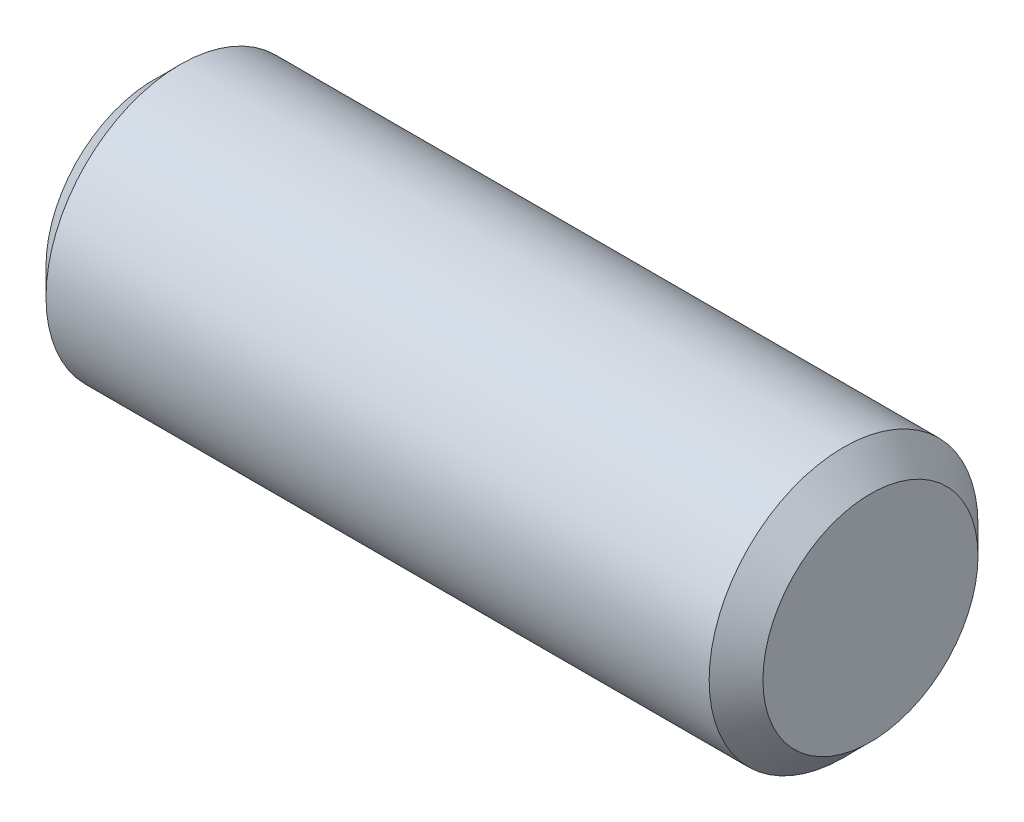
ISO-10303-21;
HEADER;
FILE_DESCRIPTION(('STEP AP214'),'2;1');
FILE_NAME('part.step','',(''),(''),'','','');
FILE_SCHEMA(('AUTOMOTIVE_DESIGN { 1 0 10303 214 1 1 1 1 }'));
ENDSEC;
DATA;
#1=APPLICATION_CONTEXT('core data for automotive mechanical design processes');
#2=APPLICATION_PROTOCOL_DEFINITION('international standard','automotive_design',2000,#1);
#3=PRODUCT_CONTEXT('',#1,'mechanical');
#4=PRODUCT('Part','Part','',(#3));
#5=PRODUCT_RELATED_PRODUCT_CATEGORY('part','',(#4));
#6=PRODUCT_DEFINITION_FORMATION('','',#4);
#7=PRODUCT_DEFINITION_CONTEXT('part definition',#1,'design');
#8=PRODUCT_DEFINITION('design','',#6,#7);
#9=PRODUCT_DEFINITION_SHAPE('','',#8);
#10=(LENGTH_UNIT() NAMED_UNIT(*) SI_UNIT(.MILLI.,.METRE.));
#11=(NAMED_UNIT(*) PLANE_ANGLE_UNIT() SI_UNIT($,.RADIAN.));
#12=(NAMED_UNIT(*) SI_UNIT($,.STERADIAN.) SOLID_ANGLE_UNIT());
#13=UNCERTAINTY_MEASURE_WITH_UNIT(LENGTH_MEASURE(1.E-05),#10,'distance_accuracy_value','');
#14=(GEOMETRIC_REPRESENTATION_CONTEXT(3) GLOBAL_UNCERTAINTY_ASSIGNED_CONTEXT((#13)) GLOBAL_UNIT_ASSIGNED_CONTEXT((#10,
#11,#12)) REPRESENTATION_CONTEXT('',''));
#15=CARTESIAN_POINT('',(0.,0.,0.));
#16=DIRECTION('',(0.,0.,1.));
#17=DIRECTION('',(1.,0.,0.));
#18=AXIS2_PLACEMENT_3D('',#15,#16,#17);
#19=CARTESIAN_POINT('',(-6.35,0.,0.));
#20=DIRECTION('',(1.,0.,0.));
#21=DIRECTION('',(0.,0.,-1.));
#22=AXIS2_PLACEMENT_3D('',#19,#20,#21);
#23=CYLINDRICAL_SURFACE('',#22,2.38125);
#24=CARTESIAN_POINT('',(5.87375,0.,0.));
#25=DIRECTION('',(1.,0.,0.));
#26=DIRECTION('',(0.,0.,-1.));
#27=AXIS2_PLACEMENT_3D('',#24,#25,#26);
#28=CIRCLE('',#27,2.38125);
#29=CARTESIAN_POINT('',(5.87375,0.,-2.38125));
#30=VERTEX_POINT('',#29);
#31=EDGE_CURVE('E39',#30,#30,#28,.F.);
#32=ORIENTED_EDGE('',*,*,#31,.T.);
#33=EDGE_LOOP('',(#32));
#34=FACE_BOUND('',#33,.T.);
#35=CARTESIAN_POINT('',(-5.87375,0.,0.));
#36=DIRECTION('',(1.,0.,0.));
#37=DIRECTION('',(0.,0.,-1.));
#38=AXIS2_PLACEMENT_3D('',#35,#36,#37);
#39=CIRCLE('',#38,2.38125);
#40=CARTESIAN_POINT('',(-5.87375,0.,-2.38125));
#41=VERTEX_POINT('',#40);
#42=EDGE_CURVE('E43',#41,#41,#39,.T.);
#43=ORIENTED_EDGE('',*,*,#42,.T.);
#44=EDGE_LOOP('',(#43));
#45=FACE_BOUND('',#44,.T.);
#46=ADVANCED_FACE('F32',(#34,#45),#23,.T.);
#47=CARTESIAN_POINT('',(-6.35,0.,0.));
#48=DIRECTION('',(1.,0.,0.));
#49=DIRECTION('',(0.,0.,-1.));
#50=AXIS2_PLACEMENT_3D('',#47,#48,#49);
#51=PLANE('',#50);
#52=CARTESIAN_POINT('',(-6.35,0.,0.));
#53=DIRECTION('',(1.,0.,0.));
#54=DIRECTION('',(0.,0.,-1.));
#55=AXIS2_PLACEMENT_3D('',#52,#53,#54);
#56=CIRCLE('',#55,1.905);
#57=CARTESIAN_POINT('',(-6.35,0.,-1.905));
#58=VERTEX_POINT('',#57);
#59=EDGE_CURVE('E10',#58,#58,#56,.F.);
#60=ORIENTED_EDGE('',*,*,#59,.T.);
#61=EDGE_LOOP('',(#60));
#62=FACE_BOUND('',#61,.T.);
#63=ADVANCED_FACE('F63',(#62),#51,.F.);
#64=CARTESIAN_POINT('',(6.35,0.,0.));
#65=DIRECTION('',(1.,0.,0.));
#66=DIRECTION('',(0.,0.,-1.));
#67=AXIS2_PLACEMENT_3D('',#64,#65,#66);
#68=PLANE('',#67);
#69=CARTESIAN_POINT('',(6.35,0.,0.));
#70=DIRECTION('',(1.,0.,0.));
#71=DIRECTION('',(0.,0.,-1.));
#72=AXIS2_PLACEMENT_3D('',#69,#70,#71);
#73=CIRCLE('',#72,1.905);
#74=CARTESIAN_POINT('',(6.35,0.,-1.905));
#75=VERTEX_POINT('',#74);
#76=EDGE_CURVE('E47',#75,#75,#73,.T.);
#77=ORIENTED_EDGE('',*,*,#76,.T.);
#78=EDGE_LOOP('',(#77));
#79=FACE_BOUND('',#78,.T.);
#80=ADVANCED_FACE('F53',(#79),#68,.T.);
#81=CARTESIAN_POINT('',(6.35,0.,0.));
#82=DIRECTION('',(-1.,0.,0.));
#83=DIRECTION('',(0.,0.,1.));
#84=AXIS2_PLACEMENT_3D('',#81,#82,#83);
#85=CONICAL_SURFACE('',#84,1.905,0.785398163397449);
#86=ORIENTED_EDGE('',*,*,#31,.F.);
#87=EDGE_LOOP('',(#86));
#88=FACE_BOUND('',#87,.T.);
#89=ORIENTED_EDGE('',*,*,#76,.F.);
#90=EDGE_LOOP('',(#89));
#91=FACE_BOUND('',#90,.T.);
#92=ADVANCED_FACE('F55',(#88,#91),#85,.T.);
#93=CARTESIAN_POINT('',(-5.87375,0.,0.));
#94=DIRECTION('',(1.,0.,0.));
#95=DIRECTION('',(0.,0.,-1.));
#96=AXIS2_PLACEMENT_3D('',#93,#94,#95);
#97=CONICAL_SURFACE('',#96,2.38125,0.785398163397449);
#98=ORIENTED_EDGE('',*,*,#59,.F.);
#99=EDGE_LOOP('',(#98));
#100=FACE_BOUND('',#99,.T.);
#101=ORIENTED_EDGE('',*,*,#42,.F.);
#102=EDGE_LOOP('',(#101));
#103=FACE_BOUND('',#102,.T.);
#104=ADVANCED_FACE('F34',(#100,#103),#97,.T.);
#105=CLOSED_SHELL('',(#46,#63,#80,#92,#104));
#106=MANIFOLD_SOLID_BREP('B2',#105);
#107=ADVANCED_BREP_SHAPE_REPRESENTATION('',(#18,#106),#14);
#108=SHAPE_DEFINITION_REPRESENTATION(#9,#107);
ENDSEC;
END-ISO-10303-21;
